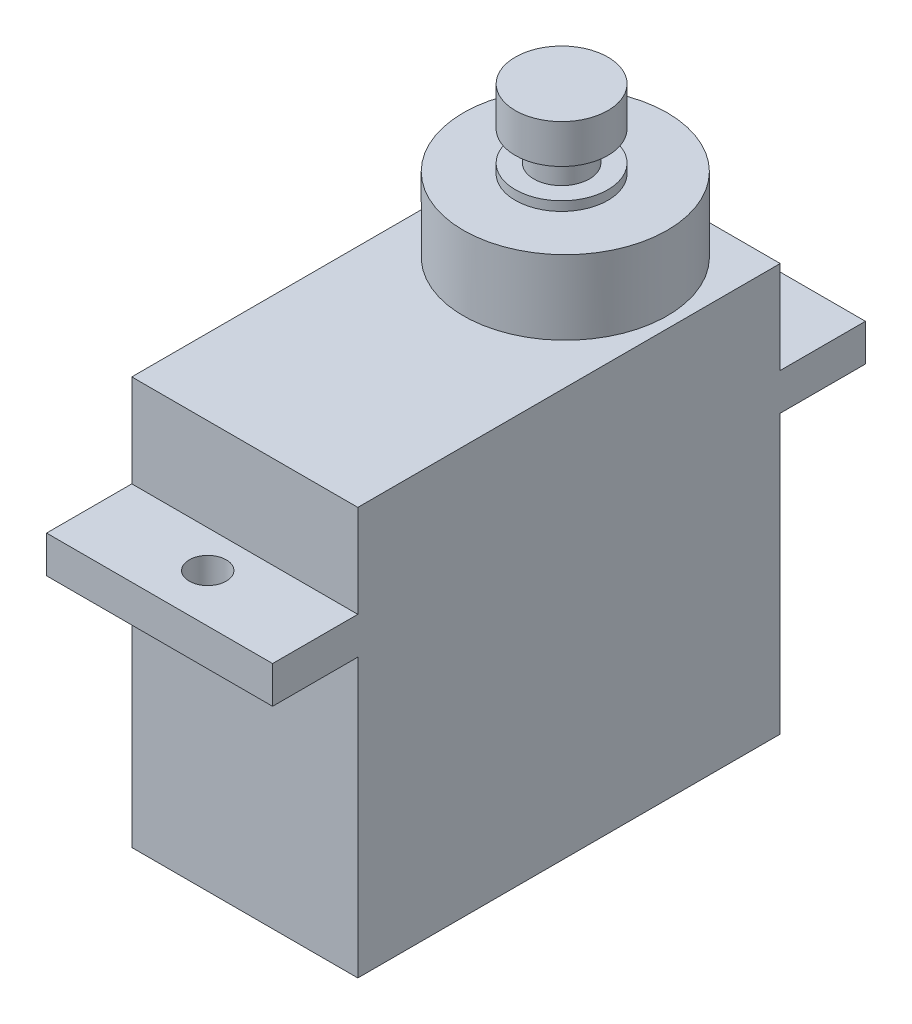
ISO-10303-21;
HEADER;
FILE_DESCRIPTION(('STEP AP214'),'2;1');
FILE_NAME('part.step','',(''),(''),'','','');
FILE_SCHEMA(('AUTOMOTIVE_DESIGN { 1 0 10303 214 1 1 1 1 }'));
ENDSEC;
DATA;
#1=APPLICATION_CONTEXT('core data for automotive mechanical design processes');
#2=APPLICATION_PROTOCOL_DEFINITION('international standard','automotive_design',2000,#1);
#3=PRODUCT_CONTEXT('',#1,'mechanical');
#4=PRODUCT('Part','Part','',(#3));
#5=PRODUCT_RELATED_PRODUCT_CATEGORY('part','',(#4));
#6=PRODUCT_DEFINITION_FORMATION('','',#4);
#7=PRODUCT_DEFINITION_CONTEXT('part definition',#1,'design');
#8=PRODUCT_DEFINITION('design','',#6,#7);
#9=PRODUCT_DEFINITION_SHAPE('','',#8);
#10=(LENGTH_UNIT() NAMED_UNIT(*) SI_UNIT(.MILLI.,.METRE.));
#11=(NAMED_UNIT(*) PLANE_ANGLE_UNIT() SI_UNIT($,.RADIAN.));
#12=(NAMED_UNIT(*) SI_UNIT($,.STERADIAN.) SOLID_ANGLE_UNIT());
#13=UNCERTAINTY_MEASURE_WITH_UNIT(LENGTH_MEASURE(1.E-05),#10,'distance_accuracy_value','');
#14=(GEOMETRIC_REPRESENTATION_CONTEXT(3) GLOBAL_UNCERTAINTY_ASSIGNED_CONTEXT((#13)) GLOBAL_UNIT_ASSIGNED_CONTEXT((#10,
#11,#12)) REPRESENTATION_CONTEXT('',''));
#15=CARTESIAN_POINT('',(0.,0.,0.));
#16=DIRECTION('',(0.,0.,1.));
#17=DIRECTION('',(1.,0.,0.));
#18=AXIS2_PLACEMENT_3D('',#15,#16,#17);
#19=CARTESIAN_POINT('',(0.,30.2,-5.7));
#20=DIRECTION('',(0.,-1.,0.));
#21=DIRECTION('',(0.,0.,-1.));
#22=AXIS2_PLACEMENT_3D('',#19,#20,#21);
#23=CYLINDRICAL_SURFACE('',#22,2.5);
#24=CARTESIAN_POINT('',(0.,26.,-5.7));
#25=DIRECTION('',(0.,1.,0.));
#26=DIRECTION('',(0.,0.,1.));
#27=AXIS2_PLACEMENT_3D('',#24,#25,#26);
#28=CIRCLE('',#27,2.5);
#29=CARTESIAN_POINT('',(0.,26.,-3.2));
#30=VERTEX_POINT('',#29);
#31=EDGE_CURVE('E11',#30,#30,#28,.T.);
#32=ORIENTED_EDGE('',*,*,#31,.T.);
#33=EDGE_LOOP('',(#32));
#34=FACE_BOUND('',#33,.T.);
#35=CARTESIAN_POINT('',(0.,26.5,-5.7));
#36=DIRECTION('',(0.,1.,0.));
#37=DIRECTION('',(0.,0.,1.));
#38=AXIS2_PLACEMENT_3D('',#35,#36,#37);
#39=CIRCLE('',#38,2.5);
#40=CARTESIAN_POINT('',(0.,26.5,-3.2));
#41=VERTEX_POINT('',#40);
#42=EDGE_CURVE('E378',#41,#41,#39,.T.);
#43=ORIENTED_EDGE('',*,*,#42,.F.);
#44=EDGE_LOOP('',(#43));
#45=FACE_BOUND('',#44,.T.);
#46=ADVANCED_FACE('F49',(#34,#45),#23,.T.);
#47=CARTESIAN_POINT('',(-6.1,22.,-11.4));
#48=DIRECTION('',(0.,0.,1.));
#49=DIRECTION('',(1.,0.,0.));
#50=AXIS2_PLACEMENT_3D('',#47,#48,#49);
#51=PLANE('',#50);
#52=DIRECTION('',(1.,0.,0.));
#53=VECTOR('',#52,1.);
#54=CARTESIAN_POINT('',(-6.1,17.,-11.4));
#55=LINE('',#54,#53);
#56=CARTESIAN_POINT('',(-6.1,17.,-11.4));
#57=VERTEX_POINT('',#56);
#58=CARTESIAN_POINT('',(6.1,17.,-11.4));
#59=VERTEX_POINT('',#58);
#60=EDGE_CURVE('E275',#57,#59,#55,.T.);
#61=ORIENTED_EDGE('',*,*,#60,.F.);
#62=DIRECTION('',(0.,-1.,0.));
#63=VECTOR('',#62,1.);
#64=CARTESIAN_POINT('',(-6.1,22.,-11.4));
#65=LINE('',#64,#63);
#66=CARTESIAN_POINT('',(-6.1,22.,-11.4));
#67=VERTEX_POINT('',#66);
#68=EDGE_CURVE('E158',#67,#57,#65,.T.);
#69=ORIENTED_EDGE('',*,*,#68,.F.);
#70=DIRECTION('',(-1.,0.,0.));
#71=VECTOR('',#70,1.);
#72=CARTESIAN_POINT('',(-6.1,22.,-11.4));
#73=LINE('',#72,#71);
#74=CARTESIAN_POINT('',(0.,22.,-11.4));
#75=VERTEX_POINT('',#74);
#76=EDGE_CURVE('E153',#75,#67,#73,.T.);
#77=ORIENTED_EDGE('',*,*,#76,.F.);
#78=CARTESIAN_POINT('',(6.1,22.,-11.4));
#79=VERTEX_POINT('',#78);
#80=EDGE_CURVE('E142',#79,#75,#73,.T.);
#81=ORIENTED_EDGE('',*,*,#80,.F.);
#82=DIRECTION('',(0.,-1.,0.));
#83=VECTOR('',#82,1.);
#84=CARTESIAN_POINT('',(6.1,22.,-11.4));
#85=LINE('',#84,#83);
#86=EDGE_CURVE('E53',#79,#59,#85,.T.);
#87=ORIENTED_EDGE('',*,*,#86,.T.);
#88=EDGE_LOOP('',(#61,#69,#77,#81,#87));
#89=FACE_BOUND('',#88,.T.);
#90=ADVANCED_FACE('F156',(#89),#51,.F.);
#91=CARTESIAN_POINT('',(-6.1,22.,11.4));
#92=DIRECTION('',(0.,0.,-1.));
#93=DIRECTION('',(-1.,0.,0.));
#94=AXIS2_PLACEMENT_3D('',#91,#92,#93);
#95=PLANE('',#94);
#96=DIRECTION('',(-1.,0.,0.));
#97=VECTOR('',#96,1.);
#98=CARTESIAN_POINT('',(-6.1,17.,11.4));
#99=LINE('',#98,#97);
#100=CARTESIAN_POINT('',(6.1,17.,11.4));
#101=VERTEX_POINT('',#100);
#102=CARTESIAN_POINT('',(-6.1,17.,11.4));
#103=VERTEX_POINT('',#102);
#104=EDGE_CURVE('E232',#101,#103,#99,.T.);
#105=ORIENTED_EDGE('',*,*,#104,.F.);
#106=DIRECTION('',(0.,-1.,0.));
#107=VECTOR('',#106,1.);
#108=CARTESIAN_POINT('',(6.1,22.,11.4));
#109=LINE('',#108,#107);
#110=CARTESIAN_POINT('',(6.1,22.,11.4));
#111=VERTEX_POINT('',#110);
#112=EDGE_CURVE('E187',#111,#101,#109,.T.);
#113=ORIENTED_EDGE('',*,*,#112,.F.);
#114=DIRECTION('',(1.,0.,0.));
#115=VECTOR('',#114,1.);
#116=CARTESIAN_POINT('',(-6.1,22.,11.4));
#117=LINE('',#116,#115);
#118=CARTESIAN_POINT('',(-6.1,22.,11.4));
#119=VERTEX_POINT('',#118);
#120=EDGE_CURVE('E168',#119,#111,#117,.T.);
#121=ORIENTED_EDGE('',*,*,#120,.F.);
#122=DIRECTION('',(0.,-1.,0.));
#123=VECTOR('',#122,1.);
#124=CARTESIAN_POINT('',(-6.1,22.,11.4));
#125=LINE('',#124,#123);
#126=EDGE_CURVE('E192',#119,#103,#125,.T.);
#127=ORIENTED_EDGE('',*,*,#126,.T.);
#128=EDGE_LOOP('',(#105,#113,#121,#127));
#129=FACE_BOUND('',#128,.T.);
#130=ADVANCED_FACE('F323',(#129),#95,.F.);
#131=CARTESIAN_POINT('',(6.1,22.,11.4));
#132=DIRECTION('',(-1.,0.,0.));
#133=DIRECTION('',(0.,0.,1.));
#134=AXIS2_PLACEMENT_3D('',#131,#132,#133);
#135=PLANE('',#134);
#136=DIRECTION('',(0.,0.,-1.));
#137=VECTOR('',#136,1.);
#138=CARTESIAN_POINT('',(6.1,0.,11.4));
#139=LINE('',#138,#137);
#140=CARTESIAN_POINT('',(6.1,0.,11.4));
#141=VERTEX_POINT('',#140);
#142=CARTESIAN_POINT('',(6.1,0.,-11.4));
#143=VERTEX_POINT('',#142);
#144=EDGE_CURVE('E172',#141,#143,#139,.T.);
#145=ORIENTED_EDGE('',*,*,#144,.T.);
#146=CARTESIAN_POINT('',(6.1,15.,-11.4));
#147=VERTEX_POINT('',#146);
#148=EDGE_CURVE('E195',#147,#143,#85,.T.);
#149=ORIENTED_EDGE('',*,*,#148,.F.);
#150=DIRECTION('',(0.,0.,-1.));
#151=VECTOR('',#150,1.);
#152=CARTESIAN_POINT('',(6.1,15.,-16.));
#153=LINE('',#152,#151);
#154=CARTESIAN_POINT('',(6.1,15.,-16.));
#155=VERTEX_POINT('',#154);
#156=EDGE_CURVE('E291',#147,#155,#153,.T.);
#157=ORIENTED_EDGE('',*,*,#156,.T.);
#158=DIRECTION('',(0.,-1.,0.));
#159=VECTOR('',#158,1.);
#160=CARTESIAN_POINT('',(6.1,17.,-16.));
#161=LINE('',#160,#159);
#162=CARTESIAN_POINT('',(6.1,17.,-16.));
#163=VERTEX_POINT('',#162);
#164=EDGE_CURVE('E177',#163,#155,#161,.T.);
#165=ORIENTED_EDGE('',*,*,#164,.F.);
#166=DIRECTION('',(0.,0.,-1.));
#167=VECTOR('',#166,1.);
#168=CARTESIAN_POINT('',(6.1,17.,-16.));
#169=LINE('',#168,#167);
#170=EDGE_CURVE('E279',#59,#163,#169,.T.);
#171=ORIENTED_EDGE('',*,*,#170,.F.);
#172=ORIENTED_EDGE('',*,*,#86,.F.);
#173=DIRECTION('',(0.,0.,-1.));
#174=VECTOR('',#173,1.);
#175=CARTESIAN_POINT('',(6.1,22.,11.4));
#176=LINE('',#175,#174);
#177=EDGE_CURVE('E148',#111,#79,#176,.T.);
#178=ORIENTED_EDGE('',*,*,#177,.F.);
#179=ORIENTED_EDGE('',*,*,#112,.T.);
#180=DIRECTION('',(0.,0.,-1.));
#181=VECTOR('',#180,1.);
#182=CARTESIAN_POINT('',(6.1,17.,16.));
#183=LINE('',#182,#181);
#184=CARTESIAN_POINT('',(6.1,17.,16.));
#185=VERTEX_POINT('',#184);
#186=EDGE_CURVE('E247',#185,#101,#183,.T.);
#187=ORIENTED_EDGE('',*,*,#186,.F.);
#188=DIRECTION('',(0.,-1.,0.));
#189=VECTOR('',#188,1.);
#190=CARTESIAN_POINT('',(6.1,17.,16.));
#191=LINE('',#190,#189);
#192=CARTESIAN_POINT('',(6.1,15.,16.));
#193=VERTEX_POINT('',#192);
#194=EDGE_CURVE('E227',#185,#193,#191,.T.);
#195=ORIENTED_EDGE('',*,*,#194,.T.);
#196=DIRECTION('',(0.,0.,-1.));
#197=VECTOR('',#196,1.);
#198=CARTESIAN_POINT('',(6.1,15.,16.));
#199=LINE('',#198,#197);
#200=CARTESIAN_POINT('',(6.1,15.,11.4));
#201=VERTEX_POINT('',#200);
#202=EDGE_CURVE('E224',#193,#201,#199,.T.);
#203=ORIENTED_EDGE('',*,*,#202,.T.);
#204=EDGE_CURVE('E171',#201,#141,#109,.T.);
#205=ORIENTED_EDGE('',*,*,#204,.T.);
#206=EDGE_LOOP('',(#145,#149,#157,#165,#171,#172,#178,#179,#187,#195,#203,#205));
#207=FACE_BOUND('',#206,.T.);
#208=ADVANCED_FACE('F51',(#207),#135,.F.);
#209=CARTESIAN_POINT('',(-6.1,15.,-11.4));
#210=VERTEX_POINT('',#209);
#211=CARTESIAN_POINT('',(-6.1,0.,-11.4));
#212=VERTEX_POINT('',#211);
#213=EDGE_CURVE('E71',#210,#212,#65,.T.);
#214=ORIENTED_EDGE('',*,*,#213,.F.);
#215=DIRECTION('',(1.,0.,0.));
#216=VECTOR('',#215,1.);
#217=CARTESIAN_POINT('',(-6.1,15.,-11.4));
#218=LINE('',#217,#216);
#219=EDGE_CURVE('E66',#210,#147,#218,.T.);
#220=ORIENTED_EDGE('',*,*,#219,.T.);
#221=ORIENTED_EDGE('',*,*,#148,.T.);
#222=DIRECTION('',(-1.,0.,0.));
#223=VECTOR('',#222,1.);
#224=CARTESIAN_POINT('',(-6.1,0.,-11.4));
#225=LINE('',#224,#223);
#226=EDGE_CURVE('E176',#143,#212,#225,.T.);
#227=ORIENTED_EDGE('',*,*,#226,.T.);
#228=EDGE_LOOP('',(#214,#220,#221,#227));
#229=FACE_BOUND('',#228,.T.);
#230=ADVANCED_FACE('F209',(#229),#51,.F.);
#231=CARTESIAN_POINT('',(-6.1,22.,11.4));
#232=DIRECTION('',(1.,0.,0.));
#233=DIRECTION('',(0.,0.,-1.));
#234=AXIS2_PLACEMENT_3D('',#231,#232,#233);
#235=PLANE('',#234);
#236=DIRECTION('',(0.,0.,1.));
#237=VECTOR('',#236,1.);
#238=CARTESIAN_POINT('',(-6.1,0.,11.4));
#239=LINE('',#238,#237);
#240=CARTESIAN_POINT('',(-6.1,0.,11.4));
#241=VERTEX_POINT('',#240);
#242=EDGE_CURVE('E180',#212,#241,#239,.T.);
#243=ORIENTED_EDGE('',*,*,#242,.T.);
#244=CARTESIAN_POINT('',(-6.1,15.,11.4));
#245=VERTEX_POINT('',#244);
#246=EDGE_CURVE('E191',#245,#241,#125,.T.);
#247=ORIENTED_EDGE('',*,*,#246,.F.);
#248=DIRECTION('',(0.,0.,1.));
#249=VECTOR('',#248,1.);
#250=CARTESIAN_POINT('',(-6.1,15.,11.4));
#251=LINE('',#250,#249);
#252=CARTESIAN_POINT('',(-6.1,15.,16.));
#253=VERTEX_POINT('',#252);
#254=EDGE_CURVE('E236',#245,#253,#251,.T.);
#255=ORIENTED_EDGE('',*,*,#254,.T.);
#256=DIRECTION('',(0.,-1.,0.));
#257=VECTOR('',#256,1.);
#258=CARTESIAN_POINT('',(-6.1,17.,16.));
#259=LINE('',#258,#257);
#260=CARTESIAN_POINT('',(-6.1,17.,16.));
#261=VERTEX_POINT('',#260);
#262=EDGE_CURVE('E304',#261,#253,#259,.T.);
#263=ORIENTED_EDGE('',*,*,#262,.F.);
#264=DIRECTION('',(0.,0.,1.));
#265=VECTOR('',#264,1.);
#266=CARTESIAN_POINT('',(-6.1,17.,11.4));
#267=LINE('',#266,#265);
#268=EDGE_CURVE('E254',#103,#261,#267,.T.);
#269=ORIENTED_EDGE('',*,*,#268,.F.);
#270=ORIENTED_EDGE('',*,*,#126,.F.);
#271=DIRECTION('',(0.,0.,1.));
#272=VECTOR('',#271,1.);
#273=CARTESIAN_POINT('',(-6.1,22.,11.4));
#274=LINE('',#273,#272);
#275=EDGE_CURVE('E152',#67,#119,#274,.T.);
#276=ORIENTED_EDGE('',*,*,#275,.F.);
#277=ORIENTED_EDGE('',*,*,#68,.T.);
#278=DIRECTION('',(0.,0.,1.));
#279=VECTOR('',#278,1.);
#280=CARTESIAN_POINT('',(-6.1,17.,-11.4));
#281=LINE('',#280,#279);
#282=CARTESIAN_POINT('',(-6.1,17.,-16.));
#283=VERTEX_POINT('',#282);
#284=EDGE_CURVE('E285',#283,#57,#281,.T.);
#285=ORIENTED_EDGE('',*,*,#284,.F.);
#286=DIRECTION('',(0.,-1.,0.));
#287=VECTOR('',#286,1.);
#288=CARTESIAN_POINT('',(-6.1,17.,-16.));
#289=LINE('',#288,#287);
#290=CARTESIAN_POINT('',(-6.1,15.,-16.));
#291=VERTEX_POINT('',#290);
#292=EDGE_CURVE('E288',#283,#291,#289,.T.);
#293=ORIENTED_EDGE('',*,*,#292,.T.);
#294=DIRECTION('',(0.,0.,1.));
#295=VECTOR('',#294,1.);
#296=CARTESIAN_POINT('',(-6.1,15.,-11.4));
#297=LINE('',#296,#295);
#298=EDGE_CURVE('E207',#291,#210,#297,.T.);
#299=ORIENTED_EDGE('',*,*,#298,.T.);
#300=ORIENTED_EDGE('',*,*,#213,.T.);
#301=EDGE_LOOP('',(#243,#247,#255,#263,#269,#270,#276,#277,#285,#293,#299,#300));
#302=FACE_BOUND('',#301,.T.);
#303=ADVANCED_FACE('F201',(#302),#235,.F.);
#304=ORIENTED_EDGE('',*,*,#204,.F.);
#305=DIRECTION('',(-1.,0.,0.));
#306=VECTOR('',#305,1.);
#307=CARTESIAN_POINT('',(-6.1,15.,11.4));
#308=LINE('',#307,#306);
#309=EDGE_CURVE('E217',#201,#245,#308,.T.);
#310=ORIENTED_EDGE('',*,*,#309,.T.);
#311=ORIENTED_EDGE('',*,*,#246,.T.);
#312=DIRECTION('',(1.,0.,0.));
#313=VECTOR('',#312,1.);
#314=CARTESIAN_POINT('',(-6.1,0.,11.4));
#315=LINE('',#314,#313);
#316=EDGE_CURVE('E162',#241,#141,#315,.T.);
#317=ORIENTED_EDGE('',*,*,#316,.T.);
#318=EDGE_LOOP('',(#304,#310,#311,#317));
#319=FACE_BOUND('',#318,.T.);
#320=ADVANCED_FACE('F214',(#319),#95,.F.);
#321=CARTESIAN_POINT('',(0.,22.,0.));
#322=DIRECTION('',(0.,-1.,0.));
#323=DIRECTION('',(0.,0.,-1.));
#324=AXIS2_PLACEMENT_3D('',#321,#322,#323);
#325=PLANE('',#324);
#326=ORIENTED_EDGE('',*,*,#80,.T.);
#327=CARTESIAN_POINT('',(0.,22.,-5.9));
#328=DIRECTION('',(0.,1.,0.));
#329=DIRECTION('',(0.,0.,1.));
#330=AXIS2_PLACEMENT_3D('',#327,#328,#329);
#331=CIRCLE('',#330,5.5);
#332=EDGE_CURVE('E146',#75,#75,#331,.T.);
#333=ORIENTED_EDGE('',*,*,#332,.F.);
#334=ORIENTED_EDGE('',*,*,#76,.T.);
#335=ORIENTED_EDGE('',*,*,#275,.T.);
#336=ORIENTED_EDGE('',*,*,#120,.T.);
#337=ORIENTED_EDGE('',*,*,#177,.T.);
#338=EDGE_LOOP('',(#326,#333,#334,#335,#336,#337));
#339=FACE_BOUND('',#338,.T.);
#340=ADVANCED_FACE('F144',(#339),#325,.F.);
#341=CARTESIAN_POINT('',(0.,0.,0.));
#342=DIRECTION('',(0.,-1.,0.));
#343=DIRECTION('',(0.,0.,-1.));
#344=AXIS2_PLACEMENT_3D('',#341,#342,#343);
#345=PLANE('',#344);
#346=ORIENTED_EDGE('',*,*,#144,.F.);
#347=ORIENTED_EDGE('',*,*,#316,.F.);
#348=ORIENTED_EDGE('',*,*,#242,.F.);
#349=ORIENTED_EDGE('',*,*,#226,.F.);
#350=EDGE_LOOP('',(#346,#347,#348,#349));
#351=FACE_BOUND('',#350,.T.);
#352=ADVANCED_FACE('F212',(#351),#345,.T.);
#353=CARTESIAN_POINT('',(0.,17.,0.));
#354=DIRECTION('',(0.,1.,0.));
#355=DIRECTION('',(0.,0.,1.));
#356=AXIS2_PLACEMENT_3D('',#353,#354,#355);
#357=PLANE('',#356);
#358=ORIENTED_EDGE('',*,*,#104,.T.);
#359=ORIENTED_EDGE('',*,*,#268,.T.);
#360=DIRECTION('',(1.,0.,0.));
#361=VECTOR('',#360,1.);
#362=CARTESIAN_POINT('',(-6.1,17.,16.));
#363=LINE('',#362,#361);
#364=EDGE_CURVE('E251',#261,#185,#363,.T.);
#365=ORIENTED_EDGE('',*,*,#364,.T.);
#366=ORIENTED_EDGE('',*,*,#186,.T.);
#367=EDGE_LOOP('',(#358,#359,#365,#366));
#368=FACE_BOUND('',#367,.T.);
#369=CARTESIAN_POINT('',(0.,17.,13.4));
#370=DIRECTION('',(0.,1.,0.));
#371=DIRECTION('',(0.,0.,-1.));
#372=AXIS2_PLACEMENT_3D('',#369,#370,#371);
#373=CIRCLE('',#372,1.);
#374=CARTESIAN_POINT('',(0.,17.,12.4));
#375=VERTEX_POINT('',#374);
#376=EDGE_CURVE('E238',#375,#375,#373,.T.);
#377=ORIENTED_EDGE('',*,*,#376,.F.);
#378=EDGE_LOOP('',(#377));
#379=FACE_BOUND('',#378,.T.);
#380=ADVANCED_FACE('F319',(#368,#379),#357,.T.);
#381=CARTESIAN_POINT('',(0.,15.,0.));
#382=DIRECTION('',(0.,1.,0.));
#383=DIRECTION('',(0.,0.,1.));
#384=AXIS2_PLACEMENT_3D('',#381,#382,#383);
#385=PLANE('',#384);
#386=ORIENTED_EDGE('',*,*,#309,.F.);
#387=ORIENTED_EDGE('',*,*,#202,.F.);
#388=DIRECTION('',(1.,0.,0.));
#389=VECTOR('',#388,1.);
#390=CARTESIAN_POINT('',(-6.1,15.,16.));
#391=LINE('',#390,#389);
#392=EDGE_CURVE('E231',#253,#193,#391,.T.);
#393=ORIENTED_EDGE('',*,*,#392,.F.);
#394=ORIENTED_EDGE('',*,*,#254,.F.);
#395=EDGE_LOOP('',(#386,#387,#393,#394));
#396=FACE_BOUND('',#395,.T.);
#397=CARTESIAN_POINT('',(0.,15.,13.4));
#398=DIRECTION('',(0.,1.,0.));
#399=DIRECTION('',(0.,0.,-1.));
#400=AXIS2_PLACEMENT_3D('',#397,#398,#399);
#401=CIRCLE('',#400,1.);
#402=CARTESIAN_POINT('',(0.,15.,12.4));
#403=VERTEX_POINT('',#402);
#404=EDGE_CURVE('E243',#403,#403,#401,.T.);
#405=ORIENTED_EDGE('',*,*,#404,.T.);
#406=EDGE_LOOP('',(#405));
#407=FACE_BOUND('',#406,.T.);
#408=ADVANCED_FACE('F234',(#396,#407),#385,.F.);
#409=CARTESIAN_POINT('',(-6.1,17.,16.));
#410=DIRECTION('',(0.,0.,-1.));
#411=DIRECTION('',(-1.,0.,0.));
#412=AXIS2_PLACEMENT_3D('',#409,#410,#411);
#413=PLANE('',#412);
#414=ORIENTED_EDGE('',*,*,#392,.T.);
#415=ORIENTED_EDGE('',*,*,#194,.F.);
#416=ORIENTED_EDGE('',*,*,#364,.F.);
#417=ORIENTED_EDGE('',*,*,#262,.T.);
#418=EDGE_LOOP('',(#414,#415,#416,#417));
#419=FACE_BOUND('',#418,.T.);
#420=ADVANCED_FACE('F312',(#419),#413,.F.);
#421=CARTESIAN_POINT('',(0.,17.,13.4));
#422=DIRECTION('',(0.,-1.,0.));
#423=DIRECTION('',(0.,0.,-1.));
#424=AXIS2_PLACEMENT_3D('',#421,#422,#423);
#425=CYLINDRICAL_SURFACE('',#424,1.);
#426=ORIENTED_EDGE('',*,*,#376,.T.);
#427=EDGE_LOOP('',(#426));
#428=FACE_BOUND('',#427,.T.);
#429=ORIENTED_EDGE('',*,*,#404,.F.);
#430=EDGE_LOOP('',(#429));
#431=FACE_BOUND('',#430,.T.);
#432=ADVANCED_FACE('F409',(#428,#431),#425,.F.);
#433=CARTESIAN_POINT('',(0.,17.,0.));
#434=DIRECTION('',(0.,-1.,0.));
#435=DIRECTION('',(0.,0.,-1.));
#436=AXIS2_PLACEMENT_3D('',#433,#434,#435);
#437=PLANE('',#436);
#438=ORIENTED_EDGE('',*,*,#60,.T.);
#439=ORIENTED_EDGE('',*,*,#170,.T.);
#440=DIRECTION('',(-1.,0.,0.));
#441=VECTOR('',#440,1.);
#442=CARTESIAN_POINT('',(-6.1,17.,-16.));
#443=LINE('',#442,#441);
#444=EDGE_CURVE('E282',#163,#283,#443,.T.);
#445=ORIENTED_EDGE('',*,*,#444,.T.);
#446=ORIENTED_EDGE('',*,*,#284,.T.);
#447=EDGE_LOOP('',(#438,#439,#445,#446));
#448=FACE_BOUND('',#447,.T.);
#449=CARTESIAN_POINT('',(0.,17.,-13.4));
#450=DIRECTION('',(0.,1.,0.));
#451=DIRECTION('',(0.,0.,1.));
#452=AXIS2_PLACEMENT_3D('',#449,#450,#451);
#453=CIRCLE('',#452,1.);
#454=CARTESIAN_POINT('',(0.,17.,-12.4));
#455=VERTEX_POINT('',#454);
#456=EDGE_CURVE('E266',#455,#455,#453,.T.);
#457=ORIENTED_EDGE('',*,*,#456,.F.);
#458=EDGE_LOOP('',(#457));
#459=FACE_BOUND('',#458,.T.);
#460=ADVANCED_FACE('F328',(#448,#459),#437,.F.);
#461=CARTESIAN_POINT('',(0.,15.,0.));
#462=DIRECTION('',(0.,-1.,0.));
#463=DIRECTION('',(0.,0.,-1.));
#464=AXIS2_PLACEMENT_3D('',#461,#462,#463);
#465=PLANE('',#464);
#466=ORIENTED_EDGE('',*,*,#219,.F.);
#467=ORIENTED_EDGE('',*,*,#298,.F.);
#468=DIRECTION('',(-1.,0.,0.));
#469=VECTOR('',#468,1.);
#470=CARTESIAN_POINT('',(-6.1,15.,-16.));
#471=LINE('',#470,#469);
#472=EDGE_CURVE('E294',#155,#291,#471,.T.);
#473=ORIENTED_EDGE('',*,*,#472,.F.);
#474=ORIENTED_EDGE('',*,*,#156,.F.);
#475=EDGE_LOOP('',(#466,#467,#473,#474));
#476=FACE_BOUND('',#475,.T.);
#477=CARTESIAN_POINT('',(0.,15.,-13.4));
#478=DIRECTION('',(0.,1.,0.));
#479=DIRECTION('',(0.,0.,1.));
#480=AXIS2_PLACEMENT_3D('',#477,#478,#479);
#481=CIRCLE('',#480,1.);
#482=CARTESIAN_POINT('',(0.,15.,-12.4));
#483=VERTEX_POINT('',#482);
#484=EDGE_CURVE('E262',#483,#483,#481,.T.);
#485=ORIENTED_EDGE('',*,*,#484,.T.);
#486=EDGE_LOOP('',(#485));
#487=FACE_BOUND('',#486,.T.);
#488=ADVANCED_FACE('F335',(#476,#487),#465,.T.);
#489=CARTESIAN_POINT('',(-6.1,17.,-16.));
#490=DIRECTION('',(0.,0.,1.));
#491=DIRECTION('',(1.,0.,0.));
#492=AXIS2_PLACEMENT_3D('',#489,#490,#491);
#493=PLANE('',#492);
#494=ORIENTED_EDGE('',*,*,#472,.T.);
#495=ORIENTED_EDGE('',*,*,#292,.F.);
#496=ORIENTED_EDGE('',*,*,#444,.F.);
#497=ORIENTED_EDGE('',*,*,#164,.T.);
#498=EDGE_LOOP('',(#494,#495,#496,#497));
#499=FACE_BOUND('',#498,.T.);
#500=ADVANCED_FACE('F337',(#499),#493,.F.);
#501=CARTESIAN_POINT('',(0.,17.,-13.4));
#502=DIRECTION('',(0.,-1.,0.));
#503=DIRECTION('',(0.,0.,-1.));
#504=AXIS2_PLACEMENT_3D('',#501,#502,#503);
#505=CYLINDRICAL_SURFACE('',#504,1.);
#506=ORIENTED_EDGE('',*,*,#456,.T.);
#507=EDGE_LOOP('',(#506));
#508=FACE_BOUND('',#507,.T.);
#509=ORIENTED_EDGE('',*,*,#484,.F.);
#510=EDGE_LOOP('',(#509));
#511=FACE_BOUND('',#510,.T.);
#512=ADVANCED_FACE('F339',(#508,#511),#505,.F.);
#513=CARTESIAN_POINT('',(0.,26.,-5.9));
#514=DIRECTION('',(0.,-1.,0.));
#515=DIRECTION('',(0.,0.,-1.));
#516=AXIS2_PLACEMENT_3D('',#513,#514,#515);
#517=CYLINDRICAL_SURFACE('',#516,5.5);
#518=CARTESIAN_POINT('',(0.,26.,-5.9));
#519=DIRECTION('',(0.,1.,0.));
#520=DIRECTION('',(0.,0.,1.));
#521=AXIS2_PLACEMENT_3D('',#518,#519,#520);
#522=CIRCLE('',#521,5.5);
#523=CARTESIAN_POINT('',(0.,26.,-0.399999999999998));
#524=VERTEX_POINT('',#523);
#525=EDGE_CURVE('E308',#524,#524,#522,.T.);
#526=ORIENTED_EDGE('',*,*,#525,.F.);
#527=EDGE_LOOP('',(#526));
#528=FACE_BOUND('',#527,.T.);
#529=ORIENTED_EDGE('',*,*,#332,.T.);
#530=EDGE_LOOP('',(#529));
#531=FACE_BOUND('',#530,.T.);
#532=ADVANCED_FACE('F344',(#528,#531),#517,.T.);
#533=CARTESIAN_POINT('',(0.,26.,-5.9));
#534=DIRECTION('',(0.,1.,0.));
#535=DIRECTION('',(0.,0.,1.));
#536=AXIS2_PLACEMENT_3D('',#533,#534,#535);
#537=PLANE('',#536);
#538=ORIENTED_EDGE('',*,*,#31,.F.);
#539=EDGE_LOOP('',(#538));
#540=FACE_BOUND('',#539,.T.);
#541=ORIENTED_EDGE('',*,*,#525,.T.);
#542=EDGE_LOOP('',(#541));
#543=FACE_BOUND('',#542,.T.);
#544=ADVANCED_FACE('F397',(#540,#543),#537,.T.);
#545=CARTESIAN_POINT('',(0.,26.5,-8.2));
#546=DIRECTION('',(0.,1.,0.));
#547=DIRECTION('',(0.,0.,1.));
#548=AXIS2_PLACEMENT_3D('',#545,#546,#547);
#549=PLANE('',#548);
#550=ORIENTED_EDGE('',*,*,#42,.T.);
#551=EDGE_LOOP('',(#550));
#552=FACE_BOUND('',#551,.T.);
#553=CARTESIAN_POINT('',(0.,26.5,-5.7));
#554=DIRECTION('',(0.,1.,0.));
#555=DIRECTION('',(0.,0.,1.));
#556=AXIS2_PLACEMENT_3D('',#553,#554,#555);
#557=CIRCLE('',#556,1.5);
#558=CARTESIAN_POINT('',(0.,26.5,-4.2));
#559=VERTEX_POINT('',#558);
#560=EDGE_CURVE('E386',#559,#559,#557,.T.);
#561=ORIENTED_EDGE('',*,*,#560,.F.);
#562=EDGE_LOOP('',(#561));
#563=FACE_BOUND('',#562,.T.);
#564=ADVANCED_FACE('F404',(#552,#563),#549,.T.);
#565=CARTESIAN_POINT('',(0.,28.1,-8.2));
#566=DIRECTION('',(0.,-1.,0.));
#567=DIRECTION('',(0.,0.,-1.));
#568=AXIS2_PLACEMENT_3D('',#565,#566,#567);
#569=PLANE('',#568);
#570=CARTESIAN_POINT('',(0.,28.1,-5.7));
#571=DIRECTION('',(0.,1.,0.));
#572=DIRECTION('',(0.,0.,1.));
#573=AXIS2_PLACEMENT_3D('',#570,#571,#572);
#574=CIRCLE('',#573,1.5);
#575=CARTESIAN_POINT('',(0.,28.1,-4.2));
#576=VERTEX_POINT('',#575);
#577=EDGE_CURVE('E379',#576,#576,#574,.T.);
#578=ORIENTED_EDGE('',*,*,#577,.T.);
#579=EDGE_LOOP('',(#578));
#580=FACE_BOUND('',#579,.T.);
#581=CARTESIAN_POINT('',(0.,28.1,-5.7));
#582=DIRECTION('',(0.,1.,0.));
#583=DIRECTION('',(0.,0.,1.));
#584=AXIS2_PLACEMENT_3D('',#581,#582,#583);
#585=CIRCLE('',#584,2.5);
#586=CARTESIAN_POINT('',(0.,28.1,-3.2));
#587=VERTEX_POINT('',#586);
#588=EDGE_CURVE('E375',#587,#587,#585,.T.);
#589=ORIENTED_EDGE('',*,*,#588,.F.);
#590=EDGE_LOOP('',(#589));
#591=FACE_BOUND('',#590,.T.);
#592=ADVANCED_FACE('F559',(#580,#591),#569,.T.);
#593=CARTESIAN_POINT('',(0.,30.2,-5.7));
#594=DIRECTION('',(0.,1.,0.));
#595=DIRECTION('',(0.,0.,1.));
#596=AXIS2_PLACEMENT_3D('',#593,#594,#595);
#597=CYLINDRICAL_SURFACE('',#596,1.5);
#598=ORIENTED_EDGE('',*,*,#560,.T.);
#599=EDGE_LOOP('',(#598));
#600=FACE_BOUND('',#599,.T.);
#601=ORIENTED_EDGE('',*,*,#577,.F.);
#602=EDGE_LOOP('',(#601));
#603=FACE_BOUND('',#602,.T.);
#604=ADVANCED_FACE('F367',(#600,#603),#597,.T.);
#605=CARTESIAN_POINT('',(0.,30.2,-5.7));
#606=DIRECTION('',(0.,1.,0.));
#607=DIRECTION('',(0.,0.,1.));
#608=AXIS2_PLACEMENT_3D('',#605,#606,#607);
#609=PLANE('',#608);
#610=CARTESIAN_POINT('',(0.,30.2,-5.7));
#611=DIRECTION('',(0.,1.,0.));
#612=DIRECTION('',(0.,0.,1.));
#613=AXIS2_PLACEMENT_3D('',#610,#611,#612);
#614=CIRCLE('',#613,2.5);
#615=CARTESIAN_POINT('',(0.,30.2,-3.2));
#616=VERTEX_POINT('',#615);
#617=EDGE_CURVE('E372',#616,#616,#614,.T.);
#618=ORIENTED_EDGE('',*,*,#617,.T.);
#619=EDGE_LOOP('',(#618));
#620=FACE_BOUND('',#619,.T.);
#621=ADVANCED_FACE('F362',(#620),#609,.T.);
#622=ORIENTED_EDGE('',*,*,#617,.F.);
#623=EDGE_LOOP('',(#622));
#624=FACE_BOUND('',#623,.T.);
#625=ORIENTED_EDGE('',*,*,#588,.T.);
#626=EDGE_LOOP('',(#625));
#627=FACE_BOUND('',#626,.T.);
#628=ADVANCED_FACE('F352',(#624,#627),#23,.T.);
#629=CLOSED_SHELL('',(#46,#90,#130,#208,#230,#303,#320,#340,#352,#380,#408,#420,#432,#460,#488,
#500,#512,#532,#544,#564,#592,#604,#621,#628));
#630=MANIFOLD_SOLID_BREP('B2',#629);
#631=ADVANCED_BREP_SHAPE_REPRESENTATION('',(#18,#630),#14);
#632=SHAPE_DEFINITION_REPRESENTATION(#9,#631);
ENDSEC;
END-ISO-10303-21;
